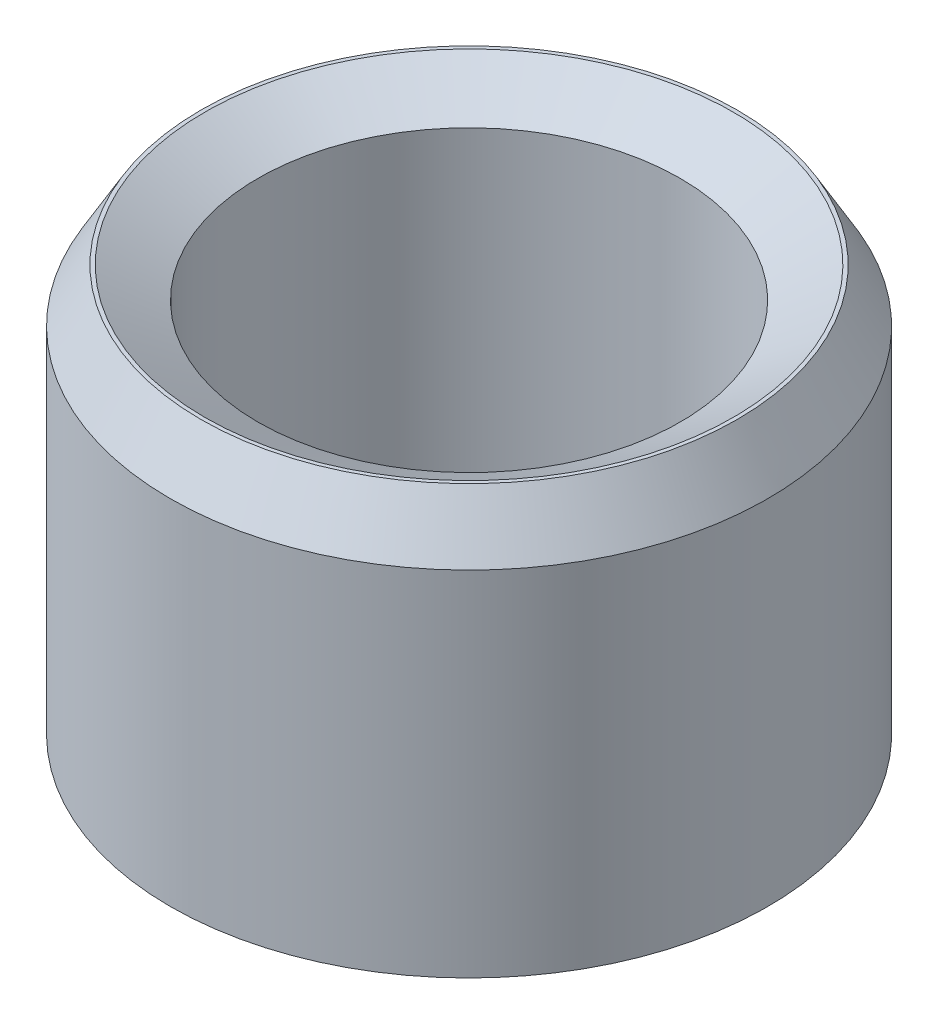
ISO-10303-21;
HEADER;
FILE_DESCRIPTION(('STEP AP214'),'2;1');
FILE_NAME('part.step','',(''),(''),'','','');
FILE_SCHEMA(('AUTOMOTIVE_DESIGN { 1 0 10303 214 1 1 1 1 }'));
ENDSEC;
DATA;
#1=APPLICATION_CONTEXT('core data for automotive mechanical design processes');
#2=APPLICATION_PROTOCOL_DEFINITION('international standard','automotive_design',2000,#1);
#3=PRODUCT_CONTEXT('',#1,'mechanical');
#4=PRODUCT('Part','Part','',(#3));
#5=PRODUCT_RELATED_PRODUCT_CATEGORY('part','',(#4));
#6=PRODUCT_DEFINITION_FORMATION('','',#4);
#7=PRODUCT_DEFINITION_CONTEXT('part definition',#1,'design');
#8=PRODUCT_DEFINITION('design','',#6,#7);
#9=PRODUCT_DEFINITION_SHAPE('','',#8);
#10=(LENGTH_UNIT() NAMED_UNIT(*) SI_UNIT(.MILLI.,.METRE.));
#11=(NAMED_UNIT(*) PLANE_ANGLE_UNIT() SI_UNIT($,.RADIAN.));
#12=(NAMED_UNIT(*) SI_UNIT($,.STERADIAN.) SOLID_ANGLE_UNIT());
#13=UNCERTAINTY_MEASURE_WITH_UNIT(LENGTH_MEASURE(1.E-05),#10,'distance_accuracy_value','');
#14=(GEOMETRIC_REPRESENTATION_CONTEXT(3) GLOBAL_UNCERTAINTY_ASSIGNED_CONTEXT((#13)) GLOBAL_UNIT_ASSIGNED_CONTEXT((#10,
#11,#12)) REPRESENTATION_CONTEXT('',''));
#15=CARTESIAN_POINT('',(0.,0.,0.));
#16=DIRECTION('',(0.,0.,1.));
#17=DIRECTION('',(1.,0.,0.));
#18=AXIS2_PLACEMENT_3D('',#15,#16,#17);
#19=CARTESIAN_POINT('',(0.,18.2873373352375,0.));
#20=DIRECTION('',(0.,-1.,0.));
#21=DIRECTION('',(0.,0.,-1.));
#22=AXIS2_PLACEMENT_3D('',#19,#20,#21);
#23=CYLINDRICAL_SURFACE('',#22,12.5);
#24=CARTESIAN_POINT('',(0.,1.28477239267855,0.));
#25=DIRECTION('',(0.,1.,0.));
#26=DIRECTION('',(0.,0.,1.));
#27=AXIS2_PLACEMENT_3D('',#24,#25,#26);
#28=CIRCLE('',#27,12.5);
#29=CARTESIAN_POINT('',(0.,1.28477239267855,12.5));
#30=VERTEX_POINT('',#29);
#31=EDGE_CURVE('E10',#30,#30,#28,.T.);
#32=ORIENTED_EDGE('',*,*,#31,.T.);
#33=EDGE_LOOP('',(#32));
#34=FACE_BOUND('',#33,.T.);
#35=CARTESIAN_POINT('',(0.,16.0620462749564,0.));
#36=DIRECTION('',(0.,1.,0.));
#37=DIRECTION('',(0.,0.,1.));
#38=AXIS2_PLACEMENT_3D('',#35,#36,#37);
#39=CIRCLE('',#38,12.5);
#40=CARTESIAN_POINT('',(0.,16.0620462749564,12.5));
#41=VERTEX_POINT('',#40);
#42=EDGE_CURVE('E50',#41,#41,#39,.F.);
#43=ORIENTED_EDGE('',*,*,#42,.T.);
#44=EDGE_LOOP('',(#43));
#45=FACE_BOUND('',#44,.T.);
#46=ADVANCED_FACE('F39',(#34,#45),#23,.T.);
#47=CARTESIAN_POINT('',(0.,18.2873373352375,0.));
#48=DIRECTION('',(0.,1.,0.));
#49=DIRECTION('',(0.,0.,1.));
#50=AXIS2_PLACEMENT_3D('',#47,#48,#49);
#51=PLANE('',#50);
#52=CARTESIAN_POINT('',(0.,18.2873373352375,0.));
#53=DIRECTION('',(0.,1.,0.));
#54=DIRECTION('',(0.,0.,1.));
#55=AXIS2_PLACEMENT_3D('',#52,#53,#54);
#56=CIRCLE('',#55,11.058781053644);
#57=CARTESIAN_POINT('',(0.,18.2873373352375,11.058781053644));
#58=VERTEX_POINT('',#57);
#59=EDGE_CURVE('E58',#58,#58,#56,.F.);
#60=ORIENTED_EDGE('',*,*,#59,.T.);
#61=EDGE_LOOP('',(#60));
#62=FACE_BOUND('',#61,.T.);
#63=CARTESIAN_POINT('',(0.,18.2873373352375,0.));
#64=DIRECTION('',(0.,1.,0.));
#65=DIRECTION('',(0.,0.,1.));
#66=AXIS2_PLACEMENT_3D('',#63,#64,#65);
#67=CIRCLE('',#66,11.2152276073214);
#68=CARTESIAN_POINT('',(0.,18.2873373352375,11.2152276073214));
#69=VERTEX_POINT('',#68);
#70=EDGE_CURVE('E61',#69,#69,#67,.T.);
#71=ORIENTED_EDGE('',*,*,#70,.T.);
#72=EDGE_LOOP('',(#71));
#73=FACE_BOUND('',#72,.T.);
#74=ADVANCED_FACE('F88',(#62,#73),#51,.T.);
#75=CARTESIAN_POINT('',(0.,0.,0.));
#76=DIRECTION('',(0.,1.,0.));
#77=DIRECTION('',(0.,0.,1.));
#78=AXIS2_PLACEMENT_3D('',#75,#76,#77);
#79=PLANE('',#78);
#80=CARTESIAN_POINT('',(0.,0.,0.));
#81=DIRECTION('',(0.,1.,0.));
#82=DIRECTION('',(0.,0.,1.));
#83=AXIS2_PLACEMENT_3D('',#80,#81,#82);
#84=CIRCLE('',#83,10.1182623860414);
#85=CARTESIAN_POINT('',(0.,0.,-10.1182623860414));
#86=VERTEX_POINT('',#85);
#87=EDGE_CURVE('E51',#86,#86,#84,.T.);
#88=ORIENTED_EDGE('',*,*,#87,.T.);
#89=EDGE_LOOP('',(#88));
#90=FACE_BOUND('',#89,.T.);
#91=CARTESIAN_POINT('',(0.,0.,0.));
#92=DIRECTION('',(0.,1.,0.));
#93=DIRECTION('',(0.,0.,1.));
#94=AXIS2_PLACEMENT_3D('',#91,#92,#93);
#95=CIRCLE('',#94,10.2747089397189);
#96=CARTESIAN_POINT('',(0.,0.,10.2747089397189));
#97=VERTEX_POINT('',#96);
#98=EDGE_CURVE('E54',#97,#97,#95,.F.);
#99=ORIENTED_EDGE('',*,*,#98,.T.);
#100=EDGE_LOOP('',(#99));
#101=FACE_BOUND('',#100,.T.);
#102=ADVANCED_FACE('F83',(#90,#101),#79,.F.);
#103=CARTESIAN_POINT('',(0.,18.2873373352375,0.));
#104=DIRECTION('',(0.,-1.,0.));
#105=DIRECTION('',(0.,0.,-1.));
#106=AXIS2_PLACEMENT_3D('',#103,#104,#105);
#107=CYLINDRICAL_SURFACE('',#106,8.83348999336288);
#108=CARTESIAN_POINT('',(0.,17.0025649425589,0.));
#109=DIRECTION('',(0.,1.,0.));
#110=DIRECTION('',(0.,0.,1.));
#111=AXIS2_PLACEMENT_3D('',#108,#109,#110);
#112=CIRCLE('',#111,8.83348999336288);
#113=CARTESIAN_POINT('',(0.,17.0025649425589,8.83348999336288));
#114=VERTEX_POINT('',#113);
#115=EDGE_CURVE('E67',#114,#114,#112,.T.);
#116=ORIENTED_EDGE('',*,*,#115,.T.);
#117=EDGE_LOOP('',(#116));
#118=FACE_BOUND('',#117,.T.);
#119=CARTESIAN_POINT('',(0.,2.22529106028111,0.));
#120=DIRECTION('',(0.,1.,0.));
#121=DIRECTION('',(0.,0.,1.));
#122=AXIS2_PLACEMENT_3D('',#119,#120,#121);
#123=CIRCLE('',#122,8.83348999336288);
#124=CARTESIAN_POINT('',(0.,2.22529106028111,-8.83348999336288));
#125=VERTEX_POINT('',#124);
#126=EDGE_CURVE('E69',#125,#125,#123,.F.);
#127=ORIENTED_EDGE('',*,*,#126,.T.);
#128=EDGE_LOOP('',(#127));
#129=FACE_BOUND('',#128,.T.);
#130=ADVANCED_FACE('F71',(#118,#129),#107,.F.);
#131=CARTESIAN_POINT('',(0.,17.0025649425589,0.));
#132=DIRECTION('',(0.,1.,0.));
#133=DIRECTION('',(0.,0.,1.));
#134=AXIS2_PLACEMENT_3D('',#131,#132,#133);
#135=CONICAL_SURFACE('',#134,8.83348999336288,1.0471975511966);
#136=ORIENTED_EDGE('',*,*,#59,.F.);
#137=EDGE_LOOP('',(#136));
#138=FACE_BOUND('',#137,.T.);
#139=ORIENTED_EDGE('',*,*,#115,.F.);
#140=EDGE_LOOP('',(#139));
#141=FACE_BOUND('',#140,.T.);
#142=ADVANCED_FACE('F77',(#138,#141),#135,.F.);
#143=CARTESIAN_POINT('',(0.,0.,0.));
#144=DIRECTION('',(0.,-1.,0.));
#145=DIRECTION('',(0.,0.,-1.));
#146=AXIS2_PLACEMENT_3D('',#143,#144,#145);
#147=CONICAL_SURFACE('',#146,10.1182623860414,0.523598775598295);
#148=CARTESIAN_POINT('',(0.,2.22529106028111,-8.83348999336288));
#149=CARTESIAN_POINT('',(0.,2.20211094506985,-8.84687303911995));
#150=CARTESIAN_POINT('',(0.,2.17893082985858,-8.86025608487702));
#151=CARTESIAN_POINT('',(0.,2.13257059943606,-8.88702217639115));
#152=CARTESIAN_POINT('',(0.,2.1093904842248,-8.90040522214822));
#153=CARTESIAN_POINT('',(0.,2.06303025380228,-8.92717131366236));
#154=CARTESIAN_POINT('',(0.,2.03985013859101,-8.94055435941943));
#155=CARTESIAN_POINT('',(0.,1.99348990816849,-8.96732045093356));
#156=CARTESIAN_POINT('',(0.,1.97030979295723,-8.98070349669063));
#157=CARTESIAN_POINT('',(0.,1.92394956253471,-9.00746958820477));
#158=CARTESIAN_POINT('',(0.,1.90076944732345,-9.02085263396184));
#159=CARTESIAN_POINT('',(0.,1.85440921690092,-9.04761872547597));
#160=CARTESIAN_POINT('',(0.,1.83122910168966,-9.06100177123304));
#161=CARTESIAN_POINT('',(0.,1.78486887126714,-9.08776786274718));
#162=CARTESIAN_POINT('',(0.,1.76168875605588,-9.10115090850424));
#163=CARTESIAN_POINT('',(0.,1.71532852563335,-9.12791700001838));
#164=CARTESIAN_POINT('',(0.,1.69214841042209,-9.14130004577545));
#165=CARTESIAN_POINT('',(0.,1.64578817999957,-9.16806613728959));
#166=CARTESIAN_POINT('',(0.,1.62260806478831,-9.18144918304665));
#167=CARTESIAN_POINT('',(0.,1.57624783436578,-9.20821527456079));
#168=CARTESIAN_POINT('',(0.,1.55306771915452,-9.22159832031786));
#169=CARTESIAN_POINT('',(0.,1.506707488732,-9.248364411832));
#170=CARTESIAN_POINT('',(0.,1.48352737352074,-9.26174745758907));
#171=CARTESIAN_POINT('',(0.,1.43716714309821,-9.2885135491032));
#172=CARTESIAN_POINT('',(0.,1.41398702788695,-9.30189659486027));
#173=CARTESIAN_POINT('',(0.,1.36762679746443,-9.32866268637441));
#174=CARTESIAN_POINT('',(0.,1.34444668225317,-9.34204573213147));
#175=CARTESIAN_POINT('',(0.,1.29808645183065,-9.36881182364561));
#176=CARTESIAN_POINT('',(0.,1.27490633661938,-9.38219486940268));
#177=CARTESIAN_POINT('',(0.,1.22854610619686,-9.40896096091681));
#178=CARTESIAN_POINT('',(0.,1.2053659909856,-9.42234400667388));
#179=CARTESIAN_POINT('',(0.,1.15900576056308,-9.44911009818802));
#180=CARTESIAN_POINT('',(0.,1.13582564535181,-9.46249314394509));
#181=CARTESIAN_POINT('',(0.,1.08946541492929,-9.48925923545923));
#182=CARTESIAN_POINT('',(0.,1.06628529971803,-9.50264228121629));
#183=CARTESIAN_POINT('',(0.,1.01992506929551,-9.52940837273043));
#184=CARTESIAN_POINT('',(0.,0.996744954084246,-9.5427914184875));
#185=CARTESIAN_POINT('',(0.,0.950384723661723,-9.56955751000164));
#186=CARTESIAN_POINT('',(0.,0.927204608450461,-9.5829405557587));
#187=CARTESIAN_POINT('',(0.,0.880844378027938,-9.60970664727284));
#188=CARTESIAN_POINT('',(0.,0.857664262816677,-9.62308969302991));
#189=CARTESIAN_POINT('',(0.,0.811304032394154,-9.64985578454404));
#190=CARTESIAN_POINT('',(0.,0.788123917182892,-9.66323883030111));
#191=CARTESIAN_POINT('',(0.,0.741763686760369,-9.69000492181525));
#192=CARTESIAN_POINT('',(0.,0.718583571549107,-9.70338796757232));
#193=CARTESIAN_POINT('',(0.,0.672223341126584,-9.73015405908645));
#194=CARTESIAN_POINT('',(0.,0.649043225915323,-9.74353710484352));
#195=CARTESIAN_POINT('',(0.,0.6026829954928,-9.77030319635766));
#196=CARTESIAN_POINT('',(0.,0.579502880281538,-9.78368624211473));
#197=CARTESIAN_POINT('',(0.,0.533142649859015,-9.81045233362886));
#198=CARTESIAN_POINT('',(0.,0.509962534647754,-9.82383537938593));
#199=CARTESIAN_POINT('',(0.,0.463602304225231,-9.85060147090007));
#200=CARTESIAN_POINT('',(0.,0.440422189013969,-9.86398451665714));
#201=CARTESIAN_POINT('',(0.,0.394061958591446,-9.89075060817127));
#202=CARTESIAN_POINT('',(0.,0.370881843380184,-9.90413365392834));
#203=CARTESIAN_POINT('',(0.,0.324521612957661,-9.93089974544248));
#204=CARTESIAN_POINT('',(0.,0.3013414977464,-9.94428279119955));
#205=CARTESIAN_POINT('',(0.,0.254981267323877,-9.97104888271368));
#206=CARTESIAN_POINT('',(0.,0.231801152112616,-9.98443192847075));
#207=CARTESIAN_POINT('',(0.,0.185440921690092,-10.0111980199849));
#208=CARTESIAN_POINT('',(0.,0.162260806478831,-10.024581065742));
#209=CARTESIAN_POINT('',(0.,0.115900576056307,-10.0513471572561));
#210=CARTESIAN_POINT('',(0.,0.092720460845046,-10.0647302030132));
#211=CARTESIAN_POINT('',(0.,0.046360230422523,-10.0914962945273));
#212=CARTESIAN_POINT('',(0.,0.0231801152112615,-10.1048793402844));
#213=CARTESIAN_POINT('',(0.,0.,-10.1182623860414));
#214=B_SPLINE_CURVE_WITH_KNOTS('',3,(#148,#149,#150,#151,#152,#153,#154,#155,#156,#157,#158,
#159,#160,#161,#162,#163,#164,#165,#166,#167,#168,#169,#170,#171,#172,#173,#174,#175,#176,#177,
#178,#179,#180,#181,#182,#183,#184,#185,#186,#187,#188,#189,#190,#191,#192,#193,#194,#195,#196,
#197,#198,#199,#200,#201,#202,#203,#204,#205,#206,#207,#208,#209,#210,#211,#212,#213),
.UNSPECIFIED.,.F.,.F.,(4,2,2,2,2,2,2,2,2,2,2,2,2,2,2,2,2,2,2,2,2,2,2,2,2,2,2,2,2,2,2,2,4),(0.,
0.0802982745424099,0.16059654908482,0.240894823627231,0.321193098169641,0.401491372712051,
0.481789647254461,0.562087921796871,0.642386196339281,0.722684470881691,0.802982745424102,
0.883281019966512,0.963579294508922,1.04387756905133,1.12417584359374,1.20447411813615,
1.28477239267856,1.36507066722097,1.44536894176338,1.52566721630579,1.6059654908482,
1.68626376539061,1.76656203993302,1.84686031447543,1.92715858901784,2.00745686356025,
2.08775513810266,2.16805341264507,2.24835168718748,2.32864996172989,2.40894823627231,
2.48924651081472,2.56954478535713),.UNSPECIFIED.);
#215=EDGE_CURVE('BSEAM73',#125,#86,#214,.T.);
#216=ORIENTED_EDGE('',*,*,#126,.F.);
#217=ORIENTED_EDGE('',*,*,#87,.F.);
#218=ORIENTED_EDGE('',*,*,#215,.T.);
#219=ORIENTED_EDGE('',*,*,#215,.F.);
#220=EDGE_LOOP('',(#216,#218,#217,#219));
#221=FACE_BOUND('',#220,.T.);
#222=ADVANCED_FACE('F73',(#221),#147,.F.);
#223=CARTESIAN_POINT('',(0.,1.28477239267855,0.));
#224=DIRECTION('',(0.,1.,0.));
#225=DIRECTION('',(0.,0.,1.));
#226=AXIS2_PLACEMENT_3D('',#223,#224,#225);
#227=CONICAL_SURFACE('',#226,12.5,1.0471975511966);
#228=ORIENTED_EDGE('',*,*,#98,.F.);
#229=EDGE_LOOP('',(#228));
#230=FACE_BOUND('',#229,.T.);
#231=ORIENTED_EDGE('',*,*,#31,.F.);
#232=EDGE_LOOP('',(#231));
#233=FACE_BOUND('',#232,.T.);
#234=ADVANCED_FACE('F76',(#230,#233),#227,.T.);
#235=CARTESIAN_POINT('',(0.,18.2873373352375,0.));
#236=DIRECTION('',(0.,-1.,0.));
#237=DIRECTION('',(0.,0.,-1.));
#238=AXIS2_PLACEMENT_3D('',#235,#236,#237);
#239=CONICAL_SURFACE('',#238,11.2152276073214,0.523598775598294);
#240=ORIENTED_EDGE('',*,*,#42,.F.);
#241=EDGE_LOOP('',(#240));
#242=FACE_BOUND('',#241,.T.);
#243=ORIENTED_EDGE('',*,*,#70,.F.);
#244=EDGE_LOOP('',(#243));
#245=FACE_BOUND('',#244,.T.);
#246=ADVANCED_FACE('F45',(#242,#245),#239,.T.);
#247=CLOSED_SHELL('',(#46,#74,#102,#130,#142,#222,#234,#246));
#248=MANIFOLD_SOLID_BREP('B2',#247);
#249=ADVANCED_BREP_SHAPE_REPRESENTATION('',(#18,#248),#14);
#250=SHAPE_DEFINITION_REPRESENTATION(#9,#249);
ENDSEC;
END-ISO-10303-21;
